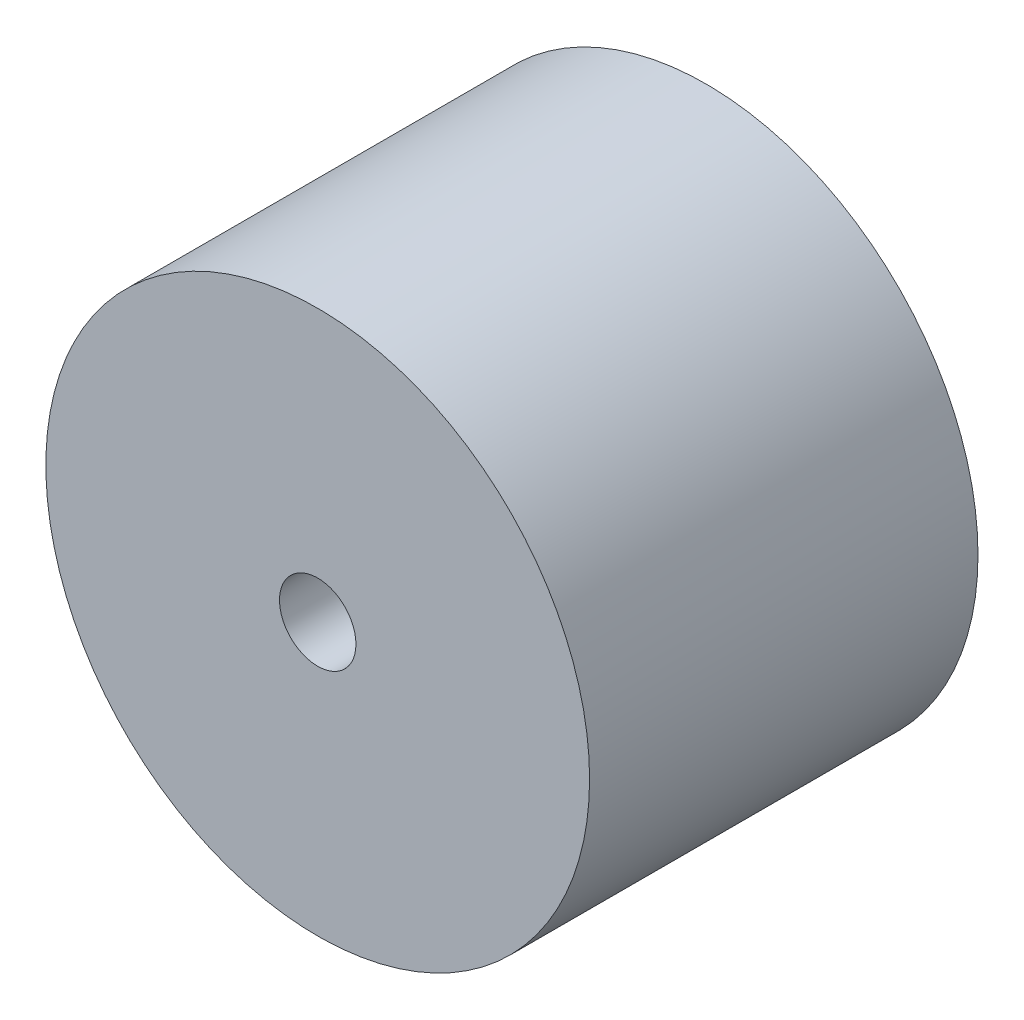
ISO-10303-21;
HEADER;
FILE_DESCRIPTION(('STEP AP214'),'2;1');
FILE_NAME('part.step','',(''),(''),'','','');
FILE_SCHEMA(('AUTOMOTIVE_DESIGN { 1 0 10303 214 1 1 1 1 }'));
ENDSEC;
DATA;
#1=APPLICATION_CONTEXT('core data for automotive mechanical design processes');
#2=APPLICATION_PROTOCOL_DEFINITION('international standard','automotive_design',2000,#1);
#3=PRODUCT_CONTEXT('',#1,'mechanical');
#4=PRODUCT('Part','Part','',(#3));
#5=PRODUCT_RELATED_PRODUCT_CATEGORY('part','',(#4));
#6=PRODUCT_DEFINITION_FORMATION('','',#4);
#7=PRODUCT_DEFINITION_CONTEXT('part definition',#1,'design');
#8=PRODUCT_DEFINITION('design','',#6,#7);
#9=PRODUCT_DEFINITION_SHAPE('','',#8);
#10=(LENGTH_UNIT() NAMED_UNIT(*) SI_UNIT(.MILLI.,.METRE.));
#11=(NAMED_UNIT(*) PLANE_ANGLE_UNIT() SI_UNIT($,.RADIAN.));
#12=(NAMED_UNIT(*) SI_UNIT($,.STERADIAN.) SOLID_ANGLE_UNIT());
#13=UNCERTAINTY_MEASURE_WITH_UNIT(LENGTH_MEASURE(1.E-05),#10,'distance_accuracy_value','');
#14=(GEOMETRIC_REPRESENTATION_CONTEXT(3) GLOBAL_UNCERTAINTY_ASSIGNED_CONTEXT((#13)) GLOBAL_UNIT_ASSIGNED_CONTEXT((#10,
#11,#12)) REPRESENTATION_CONTEXT('',''));
#15=CARTESIAN_POINT('',(0.,0.,0.));
#16=DIRECTION('',(0.,0.,1.));
#17=DIRECTION('',(1.,0.,0.));
#18=AXIS2_PLACEMENT_3D('',#15,#16,#17);
#19=CARTESIAN_POINT('',(0.,0.,25.4));
#20=DIRECTION('',(0.,0.,1.));
#21=DIRECTION('',(1.,0.,0.));
#22=AXIS2_PLACEMENT_3D('',#19,#20,#21);
#23=PLANE('',#22);
#24=CARTESIAN_POINT('',(0.,0.,25.4));
#25=DIRECTION('',(0.,0.,1.));
#26=DIRECTION('',(1.,0.,0.));
#27=AXIS2_PLACEMENT_3D('',#24,#25,#26);
#28=CIRCLE('',#27,17.78);
#29=CARTESIAN_POINT('',(17.78,0.,25.4));
#30=VERTEX_POINT('',#29);
#31=EDGE_CURVE('E10',#30,#30,#28,.T.);
#32=ORIENTED_EDGE('',*,*,#31,.T.);
#33=EDGE_LOOP('',(#32));
#34=FACE_BOUND('',#33,.T.);
#35=CARTESIAN_POINT('',(0.,0.,25.4));
#36=DIRECTION('',(0.,0.,1.));
#37=DIRECTION('',(1.,0.,0.));
#38=AXIS2_PLACEMENT_3D('',#35,#36,#37);
#39=CIRCLE('',#38,2.5);
#40=CARTESIAN_POINT('',(2.5,0.,25.4));
#41=VERTEX_POINT('',#40);
#42=EDGE_CURVE('E42',#41,#41,#39,.T.);
#43=ORIENTED_EDGE('',*,*,#42,.F.);
#44=EDGE_LOOP('',(#43));
#45=FACE_BOUND('',#44,.T.);
#46=ADVANCED_FACE('F31',(#34,#45),#23,.T.);
#47=CARTESIAN_POINT('',(0.,0.,0.));
#48=DIRECTION('',(0.,0.,1.));
#49=DIRECTION('',(1.,0.,0.));
#50=AXIS2_PLACEMENT_3D('',#47,#48,#49);
#51=PLANE('',#50);
#52=CARTESIAN_POINT('',(0.,0.,0.));
#53=DIRECTION('',(0.,0.,1.));
#54=DIRECTION('',(1.,0.,0.));
#55=AXIS2_PLACEMENT_3D('',#52,#53,#54);
#56=CIRCLE('',#55,17.78);
#57=CARTESIAN_POINT('',(17.78,0.,0.));
#58=VERTEX_POINT('',#57);
#59=EDGE_CURVE('E35',#58,#58,#56,.T.);
#60=ORIENTED_EDGE('',*,*,#59,.F.);
#61=EDGE_LOOP('',(#60));
#62=FACE_BOUND('',#61,.T.);
#63=CARTESIAN_POINT('',(0.,0.,0.));
#64=DIRECTION('',(0.,0.,1.));
#65=DIRECTION('',(1.,0.,0.));
#66=AXIS2_PLACEMENT_3D('',#63,#64,#65);
#67=CIRCLE('',#66,2.5);
#68=CARTESIAN_POINT('',(2.5,0.,0.));
#69=VERTEX_POINT('',#68);
#70=EDGE_CURVE('E44',#69,#69,#67,.T.);
#71=ORIENTED_EDGE('',*,*,#70,.T.);
#72=EDGE_LOOP('',(#71));
#73=FACE_BOUND('',#72,.T.);
#74=ADVANCED_FACE('F54',(#62,#73),#51,.F.);
#75=CARTESIAN_POINT('',(0.,0.,25.4));
#76=DIRECTION('',(0.,0.,-1.));
#77=DIRECTION('',(-1.,0.,0.));
#78=AXIS2_PLACEMENT_3D('',#75,#76,#77);
#79=CYLINDRICAL_SURFACE('',#78,17.78);
#80=ORIENTED_EDGE('',*,*,#31,.F.);
#81=EDGE_LOOP('',(#80));
#82=FACE_BOUND('',#81,.T.);
#83=ORIENTED_EDGE('',*,*,#59,.T.);
#84=EDGE_LOOP('',(#83));
#85=FACE_BOUND('',#84,.T.);
#86=ADVANCED_FACE('F33',(#82,#85),#79,.T.);
#87=CARTESIAN_POINT('',(0.,0.,25.4));
#88=DIRECTION('',(0.,0.,-1.));
#89=DIRECTION('',(-1.,0.,0.));
#90=AXIS2_PLACEMENT_3D('',#87,#88,#89);
#91=CYLINDRICAL_SURFACE('',#90,2.5);
#92=ORIENTED_EDGE('',*,*,#42,.T.);
#93=EDGE_LOOP('',(#92));
#94=FACE_BOUND('',#93,.T.);
#95=ORIENTED_EDGE('',*,*,#70,.F.);
#96=EDGE_LOOP('',(#95));
#97=FACE_BOUND('',#96,.T.);
#98=ADVANCED_FACE('F50',(#94,#97),#91,.F.);
#99=CLOSED_SHELL('',(#46,#74,#86,#98));
#100=MANIFOLD_SOLID_BREP('B2',#99);
#101=ADVANCED_BREP_SHAPE_REPRESENTATION('',(#18,#100),#14);
#102=SHAPE_DEFINITION_REPRESENTATION(#9,#101);
ENDSEC;
END-ISO-10303-21;
